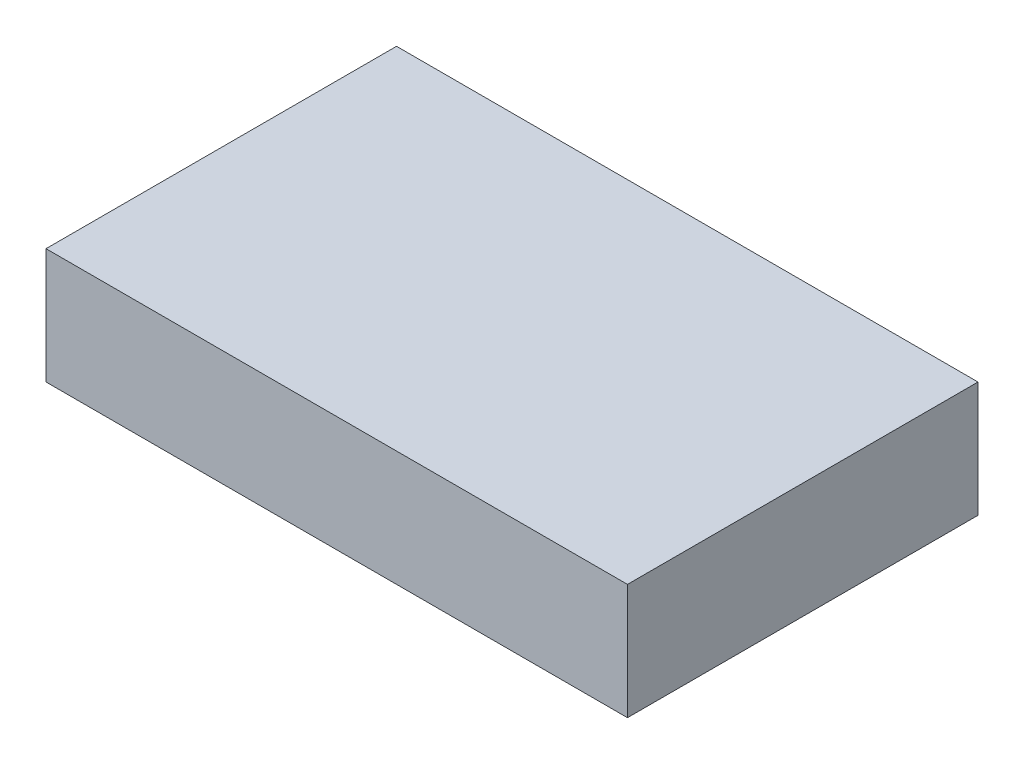
ISO-10303-21;
HEADER;
FILE_DESCRIPTION(('STEP AP214'),'2;1');
FILE_NAME('part.step','',(''),(''),'','','');
FILE_SCHEMA(('AUTOMOTIVE_DESIGN { 1 0 10303 214 1 1 1 1 }'));
ENDSEC;
DATA;
#1=APPLICATION_CONTEXT('core data for automotive mechanical design processes');
#2=APPLICATION_PROTOCOL_DEFINITION('international standard','automotive_design',2000,#1);
#3=PRODUCT_CONTEXT('',#1,'mechanical');
#4=PRODUCT('Part','Part','',(#3));
#5=PRODUCT_RELATED_PRODUCT_CATEGORY('part','',(#4));
#6=PRODUCT_DEFINITION_FORMATION('','',#4);
#7=PRODUCT_DEFINITION_CONTEXT('part definition',#1,'design');
#8=PRODUCT_DEFINITION('design','',#6,#7);
#9=PRODUCT_DEFINITION_SHAPE('','',#8);
#10=(LENGTH_UNIT() NAMED_UNIT(*) SI_UNIT(.MILLI.,.METRE.));
#11=(NAMED_UNIT(*) PLANE_ANGLE_UNIT() SI_UNIT($,.RADIAN.));
#12=(NAMED_UNIT(*) SI_UNIT($,.STERADIAN.) SOLID_ANGLE_UNIT());
#13=UNCERTAINTY_MEASURE_WITH_UNIT(LENGTH_MEASURE(1.E-05),#10,'distance_accuracy_value','');
#14=(GEOMETRIC_REPRESENTATION_CONTEXT(3) GLOBAL_UNCERTAINTY_ASSIGNED_CONTEXT((#13)) GLOBAL_UNIT_ASSIGNED_CONTEXT((#10,
#11,#12)) REPRESENTATION_CONTEXT('',''));
#15=CARTESIAN_POINT('',(0.,0.,0.));
#16=DIRECTION('',(0.,0.,1.));
#17=DIRECTION('',(1.,0.,0.));
#18=AXIS2_PLACEMENT_3D('',#15,#16,#17);
#19=CARTESIAN_POINT('',(-70.5,28.,42.5));
#20=DIRECTION('',(1.,0.,0.));
#21=DIRECTION('',(0.,0.,-1.));
#22=AXIS2_PLACEMENT_3D('',#19,#20,#21);
#23=PLANE('',#22);
#24=DIRECTION('',(0.,0.,1.));
#25=VECTOR('',#24,1.);
#26=CARTESIAN_POINT('',(-70.5,0.,42.5));
#27=LINE('',#26,#25);
#28=CARTESIAN_POINT('',(-70.5,0.,-42.5));
#29=VERTEX_POINT('',#28);
#30=CARTESIAN_POINT('',(-70.5,0.,42.5));
#31=VERTEX_POINT('',#30);
#32=EDGE_CURVE('E96',#29,#31,#27,.T.);
#33=ORIENTED_EDGE('',*,*,#32,.T.);
#34=DIRECTION('',(0.,-1.,0.));
#35=VECTOR('',#34,1.);
#36=CARTESIAN_POINT('',(-70.5,28.,42.5));
#37=LINE('',#36,#35);
#38=CARTESIAN_POINT('',(-70.5,28.,42.5));
#39=VERTEX_POINT('',#38);
#40=EDGE_CURVE('E11',#39,#31,#37,.T.);
#41=ORIENTED_EDGE('',*,*,#40,.F.);
#42=DIRECTION('',(0.,0.,1.));
#43=VECTOR('',#42,1.);
#44=CARTESIAN_POINT('',(-70.5,28.,42.5));
#45=LINE('',#44,#43);
#46=CARTESIAN_POINT('',(-70.5,28.,-42.5));
#47=VERTEX_POINT('',#46);
#48=EDGE_CURVE('E84',#47,#39,#45,.T.);
#49=ORIENTED_EDGE('',*,*,#48,.F.);
#50=DIRECTION('',(0.,-1.,0.));
#51=VECTOR('',#50,1.);
#52=CARTESIAN_POINT('',(-70.5,28.,-42.5));
#53=LINE('',#52,#51);
#54=EDGE_CURVE('E92',#47,#29,#53,.T.);
#55=ORIENTED_EDGE('',*,*,#54,.T.);
#56=EDGE_LOOP('',(#33,#41,#49,#55));
#57=FACE_BOUND('',#56,.T.);
#58=ADVANCED_FACE('F33',(#57),#23,.F.);
#59=CARTESIAN_POINT('',(70.5,28.,42.5));
#60=DIRECTION('',(0.,0.,-1.));
#61=DIRECTION('',(-1.,0.,0.));
#62=AXIS2_PLACEMENT_3D('',#59,#60,#61);
#63=PLANE('',#62);
#64=DIRECTION('',(1.,0.,0.));
#65=VECTOR('',#64,1.);
#66=CARTESIAN_POINT('',(70.5,0.,42.5));
#67=LINE('',#66,#65);
#68=CARTESIAN_POINT('',(70.5,0.,42.5));
#69=VERTEX_POINT('',#68);
#70=EDGE_CURVE('E88',#31,#69,#67,.T.);
#71=ORIENTED_EDGE('',*,*,#70,.T.);
#72=DIRECTION('',(0.,-1.,0.));
#73=VECTOR('',#72,1.);
#74=CARTESIAN_POINT('',(70.5,28.,42.5));
#75=LINE('',#74,#73);
#76=CARTESIAN_POINT('',(70.5,28.,42.5));
#77=VERTEX_POINT('',#76);
#78=EDGE_CURVE('E41',#77,#69,#75,.T.);
#79=ORIENTED_EDGE('',*,*,#78,.F.);
#80=DIRECTION('',(1.,0.,0.));
#81=VECTOR('',#80,1.);
#82=CARTESIAN_POINT('',(70.5,28.,42.5));
#83=LINE('',#82,#81);
#84=EDGE_CURVE('E79',#39,#77,#83,.T.);
#85=ORIENTED_EDGE('',*,*,#84,.F.);
#86=ORIENTED_EDGE('',*,*,#40,.T.);
#87=EDGE_LOOP('',(#71,#79,#85,#86));
#88=FACE_BOUND('',#87,.T.);
#89=ADVANCED_FACE('F87',(#88),#63,.F.);
#90=CARTESIAN_POINT('',(70.5,28.,42.5));
#91=DIRECTION('',(-1.,0.,0.));
#92=DIRECTION('',(0.,0.,1.));
#93=AXIS2_PLACEMENT_3D('',#90,#91,#92);
#94=PLANE('',#93);
#95=DIRECTION('',(0.,0.,-1.));
#96=VECTOR('',#95,1.);
#97=CARTESIAN_POINT('',(70.5,0.,42.5));
#98=LINE('',#97,#96);
#99=CARTESIAN_POINT('',(70.5,0.,-42.5));
#100=VERTEX_POINT('',#99);
#101=EDGE_CURVE('E66',#69,#100,#98,.T.);
#102=ORIENTED_EDGE('',*,*,#101,.T.);
#103=DIRECTION('',(0.,-1.,0.));
#104=VECTOR('',#103,1.);
#105=CARTESIAN_POINT('',(70.5,28.,-42.5));
#106=LINE('',#105,#104);
#107=CARTESIAN_POINT('',(70.5,28.,-42.5));
#108=VERTEX_POINT('',#107);
#109=EDGE_CURVE('E89',#108,#100,#106,.T.);
#110=ORIENTED_EDGE('',*,*,#109,.F.);
#111=DIRECTION('',(0.,0.,-1.));
#112=VECTOR('',#111,1.);
#113=CARTESIAN_POINT('',(70.5,28.,42.5));
#114=LINE('',#113,#112);
#115=EDGE_CURVE('E82',#77,#108,#114,.T.);
#116=ORIENTED_EDGE('',*,*,#115,.F.);
#117=ORIENTED_EDGE('',*,*,#78,.T.);
#118=EDGE_LOOP('',(#102,#110,#116,#117));
#119=FACE_BOUND('',#118,.T.);
#120=ADVANCED_FACE('F90',(#119),#94,.F.);
#121=CARTESIAN_POINT('',(70.5,28.,-42.5));
#122=DIRECTION('',(0.,0.,1.));
#123=DIRECTION('',(1.,0.,0.));
#124=AXIS2_PLACEMENT_3D('',#121,#122,#123);
#125=PLANE('',#124);
#126=DIRECTION('',(-1.,0.,0.));
#127=VECTOR('',#126,1.);
#128=CARTESIAN_POINT('',(70.5,0.,-42.5));
#129=LINE('',#128,#127);
#130=EDGE_CURVE('E72',#100,#29,#129,.T.);
#131=ORIENTED_EDGE('',*,*,#130,.T.);
#132=ORIENTED_EDGE('',*,*,#54,.F.);
#133=DIRECTION('',(-1.,0.,0.));
#134=VECTOR('',#133,1.);
#135=CARTESIAN_POINT('',(70.5,28.,-42.5));
#136=LINE('',#135,#134);
#137=EDGE_CURVE('E49',#108,#47,#136,.T.);
#138=ORIENTED_EDGE('',*,*,#137,.F.);
#139=ORIENTED_EDGE('',*,*,#109,.T.);
#140=EDGE_LOOP('',(#131,#132,#138,#139));
#141=FACE_BOUND('',#140,.T.);
#142=ADVANCED_FACE('F103',(#141),#125,.F.);
#143=CARTESIAN_POINT('',(0.,28.,0.));
#144=DIRECTION('',(0.,1.,0.));
#145=DIRECTION('',(0.,0.,1.));
#146=AXIS2_PLACEMENT_3D('',#143,#144,#145);
#147=PLANE('',#146);
#148=ORIENTED_EDGE('',*,*,#48,.T.);
#149=ORIENTED_EDGE('',*,*,#84,.T.);
#150=ORIENTED_EDGE('',*,*,#115,.T.);
#151=ORIENTED_EDGE('',*,*,#137,.T.);
#152=EDGE_LOOP('',(#148,#149,#150,#151));
#153=FACE_BOUND('',#152,.T.);
#154=ADVANCED_FACE('F80',(#153),#147,.T.);
#155=CARTESIAN_POINT('',(0.,0.,0.));
#156=DIRECTION('',(0.,1.,0.));
#157=DIRECTION('',(0.,0.,1.));
#158=AXIS2_PLACEMENT_3D('',#155,#156,#157);
#159=PLANE('',#158);
#160=ORIENTED_EDGE('',*,*,#32,.F.);
#161=ORIENTED_EDGE('',*,*,#130,.F.);
#162=ORIENTED_EDGE('',*,*,#101,.F.);
#163=ORIENTED_EDGE('',*,*,#70,.F.);
#164=EDGE_LOOP('',(#160,#161,#162,#163));
#165=FACE_BOUND('',#164,.T.);
#166=ADVANCED_FACE('F106',(#165),#159,.F.);
#167=CLOSED_SHELL('',(#58,#89,#120,#142,#154,#166));
#168=MANIFOLD_SOLID_BREP('B2',#167);
#169=ADVANCED_BREP_SHAPE_REPRESENTATION('',(#18,#168),#14);
#170=SHAPE_DEFINITION_REPRESENTATION(#9,#169);
ENDSEC;
END-ISO-10303-21;
